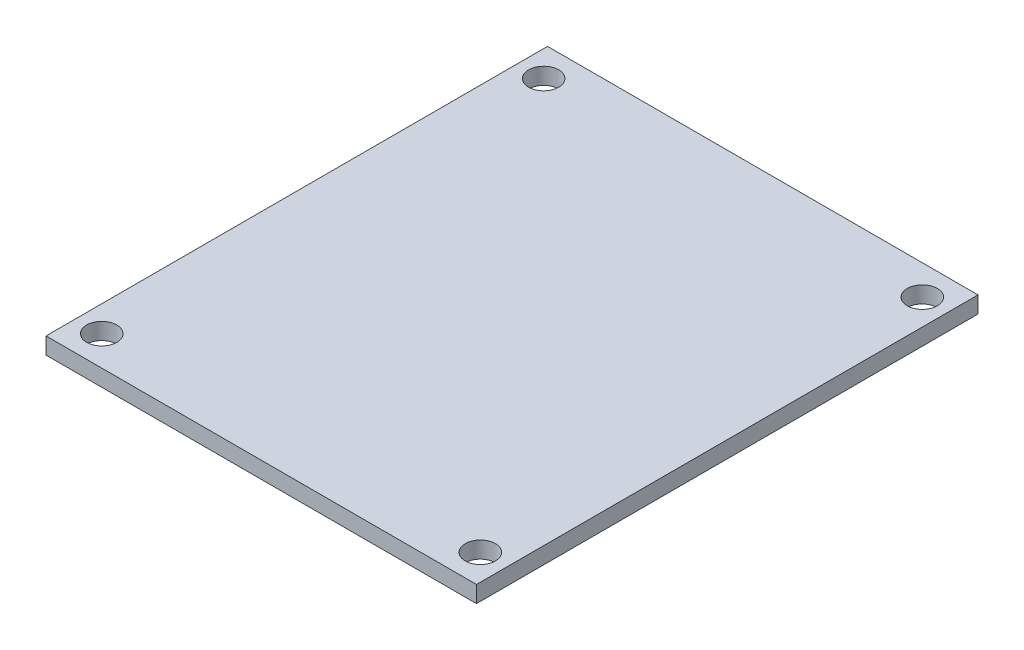
ISO-10303-21;
HEADER;
FILE_DESCRIPTION(('STEP AP214'),'2;1');
FILE_NAME('part.step','',(''),(''),'','','');
FILE_SCHEMA(('AUTOMOTIVE_DESIGN { 1 0 10303 214 1 1 1 1 }'));
ENDSEC;
DATA;
#1=APPLICATION_CONTEXT('core data for automotive mechanical design processes');
#2=APPLICATION_PROTOCOL_DEFINITION('international standard','automotive_design',2000,#1);
#3=PRODUCT_CONTEXT('',#1,'mechanical');
#4=PRODUCT('Part','Part','',(#3));
#5=PRODUCT_RELATED_PRODUCT_CATEGORY('part','',(#4));
#6=PRODUCT_DEFINITION_FORMATION('','',#4);
#7=PRODUCT_DEFINITION_CONTEXT('part definition',#1,'design');
#8=PRODUCT_DEFINITION('design','',#6,#7);
#9=PRODUCT_DEFINITION_SHAPE('','',#8);
#10=(LENGTH_UNIT() NAMED_UNIT(*) SI_UNIT(.MILLI.,.METRE.));
#11=(NAMED_UNIT(*) PLANE_ANGLE_UNIT() SI_UNIT($,.RADIAN.));
#12=(NAMED_UNIT(*) SI_UNIT($,.STERADIAN.) SOLID_ANGLE_UNIT());
#13=UNCERTAINTY_MEASURE_WITH_UNIT(LENGTH_MEASURE(1.E-05),#10,'distance_accuracy_value','');
#14=(GEOMETRIC_REPRESENTATION_CONTEXT(3) GLOBAL_UNCERTAINTY_ASSIGNED_CONTEXT((#13)) GLOBAL_UNIT_ASSIGNED_CONTEXT((#10,
#11,#12)) REPRESENTATION_CONTEXT('',''));
#15=CARTESIAN_POINT('',(0.,0.,0.));
#16=DIRECTION('',(0.,0.,1.));
#17=DIRECTION('',(1.,0.,0.));
#18=AXIS2_PLACEMENT_3D('',#15,#16,#17);
#19=CARTESIAN_POINT('',(20.72005,0.,-24.14016));
#20=DIRECTION('',(-1.,0.,0.));
#21=DIRECTION('',(0.,0.,1.));
#22=AXIS2_PLACEMENT_3D('',#19,#20,#21);
#23=PLANE('',#22);
#24=DIRECTION('',(0.,1.,0.));
#25=VECTOR('',#24,1.);
#26=CARTESIAN_POINT('',(20.72005,0.8,-24.14016));
#27=LINE('',#26,#25);
#28=CARTESIAN_POINT('',(20.72005,0.,-24.14016));
#29=VERTEX_POINT('',#28);
#30=CARTESIAN_POINT('',(20.72005,1.6,-24.14016));
#31=VERTEX_POINT('',#30);
#32=EDGE_CURVE('E66',#29,#31,#27,.T.);
#33=ORIENTED_EDGE('',*,*,#32,.T.);
#34=DIRECTION('',(0.,0.,1.));
#35=VECTOR('',#34,1.);
#36=CARTESIAN_POINT('',(20.72005,1.6,0.));
#37=LINE('',#36,#35);
#38=CARTESIAN_POINT('',(20.72005,1.6,24.14016));
#39=VERTEX_POINT('',#38);
#40=EDGE_CURVE('E105',#31,#39,#37,.T.);
#41=ORIENTED_EDGE('',*,*,#40,.T.);
#42=DIRECTION('',(0.,-1.,0.));
#43=VECTOR('',#42,1.);
#44=CARTESIAN_POINT('',(20.72005,0.8,24.14016));
#45=LINE('',#44,#43);
#46=CARTESIAN_POINT('',(20.72005,0.,24.14016));
#47=VERTEX_POINT('',#46);
#48=EDGE_CURVE('E56',#39,#47,#45,.T.);
#49=ORIENTED_EDGE('',*,*,#48,.T.);
#50=DIRECTION('',(0.,0.,1.));
#51=VECTOR('',#50,1.);
#52=CARTESIAN_POINT('',(20.72005,0.,0.));
#53=LINE('',#52,#51);
#54=EDGE_CURVE('E99',#29,#47,#53,.T.);
#55=ORIENTED_EDGE('',*,*,#54,.F.);
#56=EDGE_LOOP('',(#33,#41,#49,#55));
#57=FACE_BOUND('',#56,.T.);
#58=ADVANCED_FACE('F16',(#57),#23,.F.);
#59=CARTESIAN_POINT('',(20.72005,0.,24.14016));
#60=DIRECTION('',(0.,0.,-1.));
#61=DIRECTION('',(-1.,0.,0.));
#62=AXIS2_PLACEMENT_3D('',#59,#60,#61);
#63=PLANE('',#62);
#64=ORIENTED_EDGE('',*,*,#48,.F.);
#65=DIRECTION('',(-1.,0.,0.));
#66=VECTOR('',#65,1.);
#67=CARTESIAN_POINT('',(0.,1.6,24.14016));
#68=LINE('',#67,#66);
#69=CARTESIAN_POINT('',(-20.72005,1.6,24.14016));
#70=VERTEX_POINT('',#69);
#71=EDGE_CURVE('E72',#39,#70,#68,.T.);
#72=ORIENTED_EDGE('',*,*,#71,.T.);
#73=DIRECTION('',(0.,-1.,0.));
#74=VECTOR('',#73,1.);
#75=CARTESIAN_POINT('',(-20.72005,0.8,24.14016));
#76=LINE('',#75,#74);
#77=CARTESIAN_POINT('',(-20.72005,0.,24.14016));
#78=VERTEX_POINT('',#77);
#79=EDGE_CURVE('E62',#70,#78,#76,.T.);
#80=ORIENTED_EDGE('',*,*,#79,.T.);
#81=DIRECTION('',(-1.,0.,0.));
#82=VECTOR('',#81,1.);
#83=CARTESIAN_POINT('',(0.,0.,24.14016));
#84=LINE('',#83,#82);
#85=EDGE_CURVE('E112',#47,#78,#84,.T.);
#86=ORIENTED_EDGE('',*,*,#85,.F.);
#87=EDGE_LOOP('',(#64,#72,#80,#86));
#88=FACE_BOUND('',#87,.T.);
#89=ADVANCED_FACE('F77',(#88),#63,.F.);
#90=CARTESIAN_POINT('',(-20.72005,0.,24.14016));
#91=DIRECTION('',(1.,0.,0.));
#92=DIRECTION('',(0.,0.,-1.));
#93=AXIS2_PLACEMENT_3D('',#90,#91,#92);
#94=PLANE('',#93);
#95=ORIENTED_EDGE('',*,*,#79,.F.);
#96=DIRECTION('',(0.,0.,-1.));
#97=VECTOR('',#96,1.);
#98=CARTESIAN_POINT('',(-20.72005,1.6,0.));
#99=LINE('',#98,#97);
#100=CARTESIAN_POINT('',(-20.72005,1.6,-24.14016));
#101=VERTEX_POINT('',#100);
#102=EDGE_CURVE('E65',#70,#101,#99,.T.);
#103=ORIENTED_EDGE('',*,*,#102,.T.);
#104=DIRECTION('',(0.,-1.,0.));
#105=VECTOR('',#104,1.);
#106=CARTESIAN_POINT('',(-20.72005,0.8,-24.14016));
#107=LINE('',#106,#105);
#108=CARTESIAN_POINT('',(-20.72005,0.,-24.14016));
#109=VERTEX_POINT('',#108);
#110=EDGE_CURVE('E78',#101,#109,#107,.T.);
#111=ORIENTED_EDGE('',*,*,#110,.T.);
#112=DIRECTION('',(0.,0.,-1.));
#113=VECTOR('',#112,1.);
#114=CARTESIAN_POINT('',(-20.72005,0.,0.));
#115=LINE('',#114,#113);
#116=EDGE_CURVE('E35',#78,#109,#115,.T.);
#117=ORIENTED_EDGE('',*,*,#116,.F.);
#118=EDGE_LOOP('',(#95,#103,#111,#117));
#119=FACE_BOUND('',#118,.T.);
#120=ADVANCED_FACE('F64',(#119),#94,.F.);
#121=CARTESIAN_POINT('',(-20.72005,0.,-24.14016));
#122=DIRECTION('',(0.,0.,1.));
#123=DIRECTION('',(1.,0.,0.));
#124=AXIS2_PLACEMENT_3D('',#121,#122,#123);
#125=PLANE('',#124);
#126=ORIENTED_EDGE('',*,*,#110,.F.);
#127=DIRECTION('',(1.,0.,0.));
#128=VECTOR('',#127,1.);
#129=CARTESIAN_POINT('',(0.,1.6,-24.14016));
#130=LINE('',#129,#128);
#131=EDGE_CURVE('E75',#101,#31,#130,.T.);
#132=ORIENTED_EDGE('',*,*,#131,.T.);
#133=ORIENTED_EDGE('',*,*,#32,.F.);
#134=DIRECTION('',(1.,0.,0.));
#135=VECTOR('',#134,1.);
#136=CARTESIAN_POINT('',(0.,0.,-24.14016));
#137=LINE('',#136,#135);
#138=EDGE_CURVE('E96',#109,#29,#137,.T.);
#139=ORIENTED_EDGE('',*,*,#138,.F.);
#140=EDGE_LOOP('',(#126,#132,#133,#139));
#141=FACE_BOUND('',#140,.T.);
#142=ADVANCED_FACE('F118',(#141),#125,.F.);
#143=CARTESIAN_POINT('',(18.2245,1.6,-21.2725));
#144=DIRECTION('',(0.,-1.,0.));
#145=DIRECTION('',(0.,0.,-1.));
#146=AXIS2_PLACEMENT_3D('',#143,#144,#145);
#147=CYLINDRICAL_SURFACE('',#146,1.45);
#148=CARTESIAN_POINT('',(18.2245,1.6,-21.2725));
#149=DIRECTION('',(0.,-1.,0.));
#150=DIRECTION('',(0.,0.,-1.));
#151=AXIS2_PLACEMENT_3D('',#148,#149,#150);
#152=CIRCLE('',#151,1.45);
#153=CARTESIAN_POINT('',(18.2245,1.6,-22.7225));
#154=VERTEX_POINT('',#153);
#155=EDGE_CURVE('E20',#154,#154,#152,.F.);
#156=ORIENTED_EDGE('',*,*,#155,.T.);
#157=EDGE_LOOP('',(#156));
#158=FACE_BOUND('',#157,.T.);
#159=CARTESIAN_POINT('',(18.2245,0.,-21.2725));
#160=DIRECTION('',(0.,-1.,0.));
#161=DIRECTION('',(0.,0.,-1.));
#162=AXIS2_PLACEMENT_3D('',#159,#160,#161);
#163=CIRCLE('',#162,1.45);
#164=CARTESIAN_POINT('',(18.2245,0.,-22.7225));
#165=VERTEX_POINT('',#164);
#166=EDGE_CURVE('E93',#165,#165,#163,.F.);
#167=ORIENTED_EDGE('',*,*,#166,.F.);
#168=EDGE_LOOP('',(#167));
#169=FACE_BOUND('',#168,.T.);
#170=ADVANCED_FACE('F120',(#158,#169),#147,.F.);
#171=CARTESIAN_POINT('',(-18.2245,1.6,21.2725));
#172=DIRECTION('',(0.,-1.,0.));
#173=DIRECTION('',(0.,0.,-1.));
#174=AXIS2_PLACEMENT_3D('',#171,#172,#173);
#175=CYLINDRICAL_SURFACE('',#174,1.45);
#176=CARTESIAN_POINT('',(-18.2245,1.6,21.2725));
#177=DIRECTION('',(0.,-1.,0.));
#178=DIRECTION('',(0.,0.,-1.));
#179=AXIS2_PLACEMENT_3D('',#176,#177,#178);
#180=CIRCLE('',#179,1.45);
#181=CARTESIAN_POINT('',(-18.2245,1.6,19.8225));
#182=VERTEX_POINT('',#181);
#183=EDGE_CURVE('E100',#182,#182,#180,.F.);
#184=ORIENTED_EDGE('',*,*,#183,.T.);
#185=EDGE_LOOP('',(#184));
#186=FACE_BOUND('',#185,.T.);
#187=CARTESIAN_POINT('',(-18.2245,0.,21.2725));
#188=DIRECTION('',(0.,-1.,0.));
#189=DIRECTION('',(0.,0.,-1.));
#190=AXIS2_PLACEMENT_3D('',#187,#188,#189);
#191=CIRCLE('',#190,1.45);
#192=CARTESIAN_POINT('',(-18.2245,0.,19.8225));
#193=VERTEX_POINT('',#192);
#194=EDGE_CURVE('E90',#193,#193,#191,.F.);
#195=ORIENTED_EDGE('',*,*,#194,.F.);
#196=EDGE_LOOP('',(#195));
#197=FACE_BOUND('',#196,.T.);
#198=ADVANCED_FACE('F127',(#186,#197),#175,.F.);
#199=CARTESIAN_POINT('',(18.2245,1.6,21.2725));
#200=DIRECTION('',(0.,-1.,0.));
#201=DIRECTION('',(0.,0.,-1.));
#202=AXIS2_PLACEMENT_3D('',#199,#200,#201);
#203=CYLINDRICAL_SURFACE('',#202,1.45);
#204=CARTESIAN_POINT('',(18.2245,1.6,21.2725));
#205=DIRECTION('',(0.,-1.,0.));
#206=DIRECTION('',(0.,0.,-1.));
#207=AXIS2_PLACEMENT_3D('',#204,#205,#206);
#208=CIRCLE('',#207,1.45);
#209=CARTESIAN_POINT('',(18.2245,1.6,19.8225));
#210=VERTEX_POINT('',#209);
#211=EDGE_CURVE('E97',#210,#210,#208,.F.);
#212=ORIENTED_EDGE('',*,*,#211,.T.);
#213=EDGE_LOOP('',(#212));
#214=FACE_BOUND('',#213,.T.);
#215=CARTESIAN_POINT('',(18.2245,0.,21.2725));
#216=DIRECTION('',(0.,-1.,0.));
#217=DIRECTION('',(0.,0.,-1.));
#218=AXIS2_PLACEMENT_3D('',#215,#216,#217);
#219=CIRCLE('',#218,1.45);
#220=CARTESIAN_POINT('',(18.2245,0.,19.8225));
#221=VERTEX_POINT('',#220);
#222=EDGE_CURVE('E87',#221,#221,#219,.F.);
#223=ORIENTED_EDGE('',*,*,#222,.F.);
#224=EDGE_LOOP('',(#223));
#225=FACE_BOUND('',#224,.T.);
#226=ADVANCED_FACE('F140',(#214,#225),#203,.F.);
#227=CARTESIAN_POINT('',(-20.72005,1.6,24.14016));
#228=DIRECTION('',(0.,-1.,0.));
#229=DIRECTION('',(0.,0.,-1.));
#230=AXIS2_PLACEMENT_3D('',#227,#228,#229);
#231=PLANE('',#230);
#232=CARTESIAN_POINT('',(-18.2245,1.6,-21.2725));
#233=DIRECTION('',(0.,-1.,0.));
#234=DIRECTION('',(0.,0.,-1.));
#235=AXIS2_PLACEMENT_3D('',#232,#233,#234);
#236=CIRCLE('',#235,1.45);
#237=CARTESIAN_POINT('',(-18.2245,1.6,-22.7225));
#238=VERTEX_POINT('',#237);
#239=EDGE_CURVE('E26',#238,#238,#236,.F.);
#240=ORIENTED_EDGE('',*,*,#239,.F.);
#241=EDGE_LOOP('',(#240));
#242=FACE_BOUND('',#241,.T.);
#243=ORIENTED_EDGE('',*,*,#211,.F.);
#244=EDGE_LOOP('',(#243));
#245=FACE_BOUND('',#244,.T.);
#246=ORIENTED_EDGE('',*,*,#183,.F.);
#247=EDGE_LOOP('',(#246));
#248=FACE_BOUND('',#247,.T.);
#249=ORIENTED_EDGE('',*,*,#155,.F.);
#250=EDGE_LOOP('',(#249));
#251=FACE_BOUND('',#250,.T.);
#252=ORIENTED_EDGE('',*,*,#131,.F.);
#253=ORIENTED_EDGE('',*,*,#102,.F.);
#254=ORIENTED_EDGE('',*,*,#71,.F.);
#255=ORIENTED_EDGE('',*,*,#40,.F.);
#256=EDGE_LOOP('',(#252,#253,#254,#255));
#257=FACE_BOUND('',#256,.T.);
#258=ADVANCED_FACE('F70',(#242,#245,#248,#251,#257),#231,.F.);
#259=CARTESIAN_POINT('',(-20.72005,0.,24.14016));
#260=DIRECTION('',(0.,-1.,0.));
#261=DIRECTION('',(0.,0.,-1.));
#262=AXIS2_PLACEMENT_3D('',#259,#260,#261);
#263=PLANE('',#262);
#264=CARTESIAN_POINT('',(-18.2245,0.,-21.2725));
#265=DIRECTION('',(0.,-1.,0.));
#266=DIRECTION('',(0.,0.,-1.));
#267=AXIS2_PLACEMENT_3D('',#264,#265,#266);
#268=CIRCLE('',#267,1.45);
#269=CARTESIAN_POINT('',(-18.2245,0.,-22.7225));
#270=VERTEX_POINT('',#269);
#271=EDGE_CURVE('E11',#270,#270,#268,.T.);
#272=ORIENTED_EDGE('',*,*,#271,.F.);
#273=EDGE_LOOP('',(#272));
#274=FACE_BOUND('',#273,.T.);
#275=ORIENTED_EDGE('',*,*,#222,.T.);
#276=EDGE_LOOP('',(#275));
#277=FACE_BOUND('',#276,.T.);
#278=ORIENTED_EDGE('',*,*,#194,.T.);
#279=EDGE_LOOP('',(#278));
#280=FACE_BOUND('',#279,.T.);
#281=ORIENTED_EDGE('',*,*,#166,.T.);
#282=EDGE_LOOP('',(#281));
#283=FACE_BOUND('',#282,.T.);
#284=ORIENTED_EDGE('',*,*,#116,.T.);
#285=ORIENTED_EDGE('',*,*,#138,.T.);
#286=ORIENTED_EDGE('',*,*,#54,.T.);
#287=ORIENTED_EDGE('',*,*,#85,.T.);
#288=EDGE_LOOP('',(#284,#285,#286,#287));
#289=FACE_BOUND('',#288,.T.);
#290=ADVANCED_FACE('F18',(#274,#277,#280,#283,#289),#263,.T.);
#291=CARTESIAN_POINT('',(-18.2245,1.6,-21.2725));
#292=DIRECTION('',(0.,-1.,0.));
#293=DIRECTION('',(0.,0.,-1.));
#294=AXIS2_PLACEMENT_3D('',#291,#292,#293);
#295=CYLINDRICAL_SURFACE('',#294,1.45);
#296=ORIENTED_EDGE('',*,*,#239,.T.);
#297=EDGE_LOOP('',(#296));
#298=FACE_BOUND('',#297,.T.);
#299=ORIENTED_EDGE('',*,*,#271,.T.);
#300=EDGE_LOOP('',(#299));
#301=FACE_BOUND('',#300,.T.);
#302=ADVANCED_FACE('F130',(#298,#301),#295,.F.);
#303=CLOSED_SHELL('',(#58,#89,#120,#142,#170,#198,#226,#258,#290,#302));
#304=MANIFOLD_SOLID_BREP('B1',#303);
#305=ADVANCED_BREP_SHAPE_REPRESENTATION('',(#18,#304),#14);
#306=SHAPE_DEFINITION_REPRESENTATION(#9,#305);
ENDSEC;
END-ISO-10303-21;
